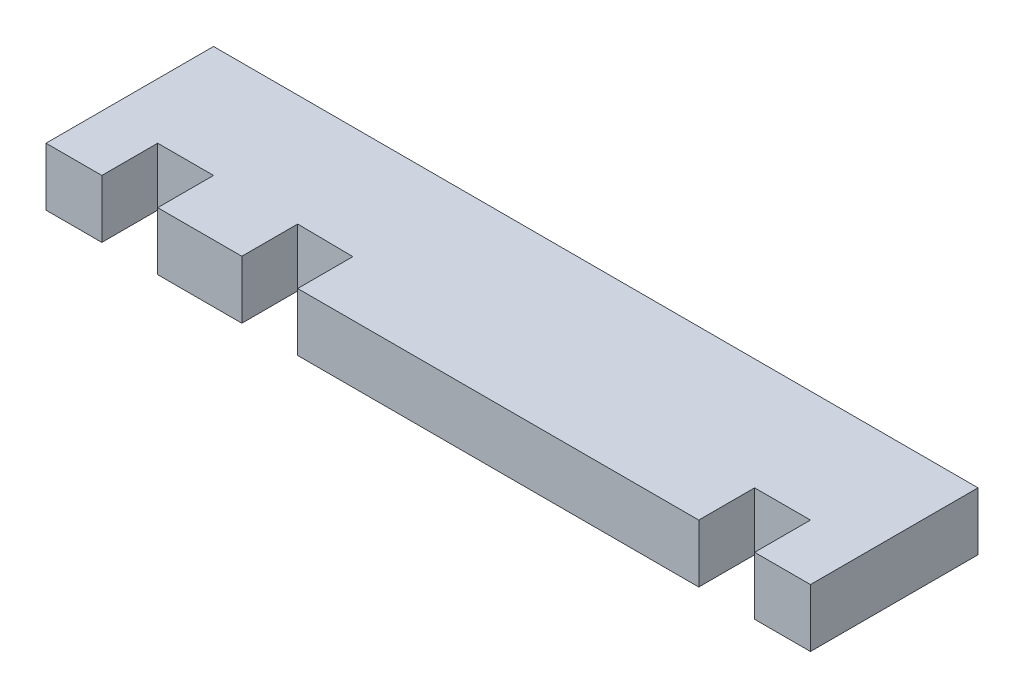
ISO-10303-21;
HEADER;
FILE_DESCRIPTION(('STEP AP214'),'2;1');
FILE_NAME('part.step','',(''),(''),'','','');
FILE_SCHEMA(('AUTOMOTIVE_DESIGN { 1 0 10303 214 1 1 1 1 }'));
ENDSEC;
DATA;
#1=APPLICATION_CONTEXT('core data for automotive mechanical design processes');
#2=APPLICATION_PROTOCOL_DEFINITION('international standard','automotive_design',2000,#1);
#3=PRODUCT_CONTEXT('',#1,'mechanical');
#4=PRODUCT('Part','Part','',(#3));
#5=PRODUCT_RELATED_PRODUCT_CATEGORY('part','',(#4));
#6=PRODUCT_DEFINITION_FORMATION('','',#4);
#7=PRODUCT_DEFINITION_CONTEXT('part definition',#1,'design');
#8=PRODUCT_DEFINITION('design','',#6,#7);
#9=PRODUCT_DEFINITION_SHAPE('','',#8);
#10=(LENGTH_UNIT() NAMED_UNIT(*) SI_UNIT(.MILLI.,.METRE.));
#11=(NAMED_UNIT(*) PLANE_ANGLE_UNIT() SI_UNIT($,.RADIAN.));
#12=(NAMED_UNIT(*) SI_UNIT($,.STERADIAN.) SOLID_ANGLE_UNIT());
#13=UNCERTAINTY_MEASURE_WITH_UNIT(LENGTH_MEASURE(1.E-05),#10,'distance_accuracy_value','');
#14=(GEOMETRIC_REPRESENTATION_CONTEXT(3) GLOBAL_UNCERTAINTY_ASSIGNED_CONTEXT((#13)) GLOBAL_UNIT_ASSIGNED_CONTEXT((#10,
#11,#12)) REPRESENTATION_CONTEXT('',''));
#15=CARTESIAN_POINT('',(0.,0.,0.));
#16=DIRECTION('',(0.,0.,1.));
#17=DIRECTION('',(1.,0.,0.));
#18=AXIS2_PLACEMENT_3D('',#15,#16,#17);
#19=CARTESIAN_POINT('',(26.35,4.,5.775));
#20=DIRECTION('',(-1.,0.,0.));
#21=DIRECTION('',(0.,0.,1.));
#22=AXIS2_PLACEMENT_3D('',#19,#20,#21);
#23=PLANE('',#22);
#24=DIRECTION('',(0.,0.,-1.));
#25=VECTOR('',#24,1.);
#26=CARTESIAN_POINT('',(26.35,0.,5.775));
#27=LINE('',#26,#25);
#28=CARTESIAN_POINT('',(26.35,0.,5.775));
#29=VERTEX_POINT('',#28);
#30=CARTESIAN_POINT('',(26.35,0.,-5.775));
#31=VERTEX_POINT('',#30);
#32=EDGE_CURVE('E303',#29,#31,#27,.T.);
#33=ORIENTED_EDGE('',*,*,#32,.T.);
#34=DIRECTION('',(0.,-1.,0.));
#35=VECTOR('',#34,1.);
#36=CARTESIAN_POINT('',(26.35,4.,-5.775));
#37=LINE('',#36,#35);
#38=CARTESIAN_POINT('',(26.35,4.,-5.775));
#39=VERTEX_POINT('',#38);
#40=EDGE_CURVE('E12',#39,#31,#37,.T.);
#41=ORIENTED_EDGE('',*,*,#40,.F.);
#42=DIRECTION('',(0.,0.,-1.));
#43=VECTOR('',#42,1.);
#44=CARTESIAN_POINT('',(26.35,4.,5.775));
#45=LINE('',#44,#43);
#46=CARTESIAN_POINT('',(26.35,4.,5.775));
#47=VERTEX_POINT('',#46);
#48=EDGE_CURVE('E244',#47,#39,#45,.T.);
#49=ORIENTED_EDGE('',*,*,#48,.F.);
#50=DIRECTION('',(0.,-1.,0.));
#51=VECTOR('',#50,1.);
#52=CARTESIAN_POINT('',(26.35,4.,5.775));
#53=LINE('',#52,#51);
#54=EDGE_CURVE('E181',#47,#29,#53,.T.);
#55=ORIENTED_EDGE('',*,*,#54,.T.);
#56=EDGE_LOOP('',(#33,#41,#49,#55));
#57=FACE_BOUND('',#56,.T.);
#58=ADVANCED_FACE('F38',(#57),#23,.F.);
#59=CARTESIAN_POINT('',(-26.35,4.,-5.775));
#60=DIRECTION('',(0.,0.,1.));
#61=DIRECTION('',(1.,0.,0.));
#62=AXIS2_PLACEMENT_3D('',#59,#60,#61);
#63=PLANE('',#62);
#64=DIRECTION('',(-1.,0.,0.));
#65=VECTOR('',#64,1.);
#66=CARTESIAN_POINT('',(-26.35,0.,-5.775));
#67=LINE('',#66,#65);
#68=CARTESIAN_POINT('',(-26.35,0.,-5.775));
#69=VERTEX_POINT('',#68);
#70=EDGE_CURVE('E297',#31,#69,#67,.T.);
#71=ORIENTED_EDGE('',*,*,#70,.T.);
#72=DIRECTION('',(0.,-1.,0.));
#73=VECTOR('',#72,1.);
#74=CARTESIAN_POINT('',(-26.35,4.,-5.775));
#75=LINE('',#74,#73);
#76=CARTESIAN_POINT('',(-26.35,4.,-5.775));
#77=VERTEX_POINT('',#76);
#78=EDGE_CURVE('E46',#77,#69,#75,.T.);
#79=ORIENTED_EDGE('',*,*,#78,.F.);
#80=DIRECTION('',(-1.,0.,0.));
#81=VECTOR('',#80,1.);
#82=CARTESIAN_POINT('',(-26.35,4.,-5.775));
#83=LINE('',#82,#81);
#84=EDGE_CURVE('E121',#39,#77,#83,.T.);
#85=ORIENTED_EDGE('',*,*,#84,.F.);
#86=ORIENTED_EDGE('',*,*,#40,.T.);
#87=EDGE_LOOP('',(#71,#79,#85,#86));
#88=FACE_BOUND('',#87,.T.);
#89=ADVANCED_FACE('F340',(#88),#63,.F.);
#90=CARTESIAN_POINT('',(-26.35,4.,-5.775));
#91=DIRECTION('',(1.,0.,0.));
#92=DIRECTION('',(0.,0.,-1.));
#93=AXIS2_PLACEMENT_3D('',#90,#91,#92);
#94=PLANE('',#93);
#95=DIRECTION('',(0.,0.,1.));
#96=VECTOR('',#95,1.);
#97=CARTESIAN_POINT('',(-26.35,0.,-5.775));
#98=LINE('',#97,#96);
#99=CARTESIAN_POINT('',(-26.35,0.,5.775));
#100=VERTEX_POINT('',#99);
#101=EDGE_CURVE('E292',#69,#100,#98,.T.);
#102=ORIENTED_EDGE('',*,*,#101,.T.);
#103=DIRECTION('',(0.,-1.,0.));
#104=VECTOR('',#103,1.);
#105=CARTESIAN_POINT('',(-26.35,4.,5.775));
#106=LINE('',#105,#104);
#107=CARTESIAN_POINT('',(-26.35,4.,5.775));
#108=VERTEX_POINT('',#107);
#109=EDGE_CURVE('E284',#108,#100,#106,.T.);
#110=ORIENTED_EDGE('',*,*,#109,.F.);
#111=DIRECTION('',(0.,0.,1.));
#112=VECTOR('',#111,1.);
#113=CARTESIAN_POINT('',(-26.35,4.,-5.775));
#114=LINE('',#113,#112);
#115=EDGE_CURVE('E236',#77,#108,#114,.T.);
#116=ORIENTED_EDGE('',*,*,#115,.F.);
#117=ORIENTED_EDGE('',*,*,#78,.T.);
#118=EDGE_LOOP('',(#102,#110,#116,#117));
#119=FACE_BOUND('',#118,.T.);
#120=ADVANCED_FACE('F290',(#119),#94,.F.);
#121=CARTESIAN_POINT('',(-26.35,4.,5.775));
#122=DIRECTION('',(0.,0.,-1.));
#123=DIRECTION('',(-1.,0.,0.));
#124=AXIS2_PLACEMENT_3D('',#121,#122,#123);
#125=PLANE('',#124);
#126=DIRECTION('',(1.,0.,0.));
#127=VECTOR('',#126,1.);
#128=CARTESIAN_POINT('',(-26.35,0.,5.775));
#129=LINE('',#128,#127);
#130=CARTESIAN_POINT('',(-22.5,0.,5.775));
#131=VERTEX_POINT('',#130);
#132=EDGE_CURVE('E299',#100,#131,#129,.T.);
#133=ORIENTED_EDGE('',*,*,#132,.T.);
#134=DIRECTION('',(0.,-1.,0.));
#135=VECTOR('',#134,1.);
#136=CARTESIAN_POINT('',(-22.5,4.,5.775));
#137=LINE('',#136,#135);
#138=CARTESIAN_POINT('',(-22.5,4.,5.775));
#139=VERTEX_POINT('',#138);
#140=EDGE_CURVE('E281',#139,#131,#137,.T.);
#141=ORIENTED_EDGE('',*,*,#140,.F.);
#142=DIRECTION('',(1.,0.,0.));
#143=VECTOR('',#142,1.);
#144=CARTESIAN_POINT('',(-26.35,4.,5.775));
#145=LINE('',#144,#143);
#146=EDGE_CURVE('E232',#108,#139,#145,.T.);
#147=ORIENTED_EDGE('',*,*,#146,.F.);
#148=ORIENTED_EDGE('',*,*,#109,.T.);
#149=EDGE_LOOP('',(#133,#141,#147,#148));
#150=FACE_BOUND('',#149,.T.);
#151=ADVANCED_FACE('F347',(#150),#125,.F.);
#152=CARTESIAN_POINT('',(-22.5,4.,5.775));
#153=DIRECTION('',(-1.,0.,0.));
#154=DIRECTION('',(0.,0.,1.));
#155=AXIS2_PLACEMENT_3D('',#152,#153,#154);
#156=PLANE('',#155);
#157=DIRECTION('',(0.,0.,-1.));
#158=VECTOR('',#157,1.);
#159=CARTESIAN_POINT('',(-22.5,0.,5.775));
#160=LINE('',#159,#158);
#161=CARTESIAN_POINT('',(-22.5,0.,1.925));
#162=VERTEX_POINT('',#161);
#163=EDGE_CURVE('E301',#131,#162,#160,.T.);
#164=ORIENTED_EDGE('',*,*,#163,.T.);
#165=DIRECTION('',(0.,-1.,0.));
#166=VECTOR('',#165,1.);
#167=CARTESIAN_POINT('',(-22.5,4.,1.925));
#168=LINE('',#167,#166);
#169=CARTESIAN_POINT('',(-22.5,4.,1.925));
#170=VERTEX_POINT('',#169);
#171=EDGE_CURVE('E278',#170,#162,#168,.T.);
#172=ORIENTED_EDGE('',*,*,#171,.F.);
#173=DIRECTION('',(0.,0.,-1.));
#174=VECTOR('',#173,1.);
#175=CARTESIAN_POINT('',(-22.5,4.,5.775));
#176=LINE('',#175,#174);
#177=EDGE_CURVE('E229',#139,#170,#176,.T.);
#178=ORIENTED_EDGE('',*,*,#177,.F.);
#179=ORIENTED_EDGE('',*,*,#140,.T.);
#180=EDGE_LOOP('',(#164,#172,#178,#179));
#181=FACE_BOUND('',#180,.T.);
#182=ADVANCED_FACE('F352',(#181),#156,.F.);
#183=CARTESIAN_POINT('',(-22.5,4.,1.925));
#184=DIRECTION('',(0.,0.,-1.));
#185=DIRECTION('',(-1.,0.,0.));
#186=AXIS2_PLACEMENT_3D('',#183,#184,#185);
#187=PLANE('',#186);
#188=DIRECTION('',(1.,0.,0.));
#189=VECTOR('',#188,1.);
#190=CARTESIAN_POINT('',(-22.5,0.,1.925));
#191=LINE('',#190,#189);
#192=CARTESIAN_POINT('',(-18.65,0.,1.925));
#193=VERTEX_POINT('',#192);
#194=EDGE_CURVE('E307',#162,#193,#191,.T.);
#195=ORIENTED_EDGE('',*,*,#194,.T.);
#196=DIRECTION('',(0.,-1.,0.));
#197=VECTOR('',#196,1.);
#198=CARTESIAN_POINT('',(-18.65,4.,1.925));
#199=LINE('',#198,#197);
#200=CARTESIAN_POINT('',(-18.65,4.,1.925));
#201=VERTEX_POINT('',#200);
#202=EDGE_CURVE('E275',#201,#193,#199,.T.);
#203=ORIENTED_EDGE('',*,*,#202,.F.);
#204=DIRECTION('',(1.,0.,0.));
#205=VECTOR('',#204,1.);
#206=CARTESIAN_POINT('',(-22.5,4.,1.925));
#207=LINE('',#206,#205);
#208=EDGE_CURVE('E221',#170,#201,#207,.T.);
#209=ORIENTED_EDGE('',*,*,#208,.F.);
#210=ORIENTED_EDGE('',*,*,#171,.T.);
#211=EDGE_LOOP('',(#195,#203,#209,#210));
#212=FACE_BOUND('',#211,.T.);
#213=ADVANCED_FACE('F356',(#212),#187,.F.);
#214=CARTESIAN_POINT('',(-18.65,4.,1.925));
#215=DIRECTION('',(1.,0.,0.));
#216=DIRECTION('',(0.,0.,-1.));
#217=AXIS2_PLACEMENT_3D('',#214,#215,#216);
#218=PLANE('',#217);
#219=DIRECTION('',(0.,0.,1.));
#220=VECTOR('',#219,1.);
#221=CARTESIAN_POINT('',(-18.65,0.,1.925));
#222=LINE('',#221,#220);
#223=CARTESIAN_POINT('',(-18.65,0.,5.775));
#224=VERTEX_POINT('',#223);
#225=EDGE_CURVE('E309',#193,#224,#222,.T.);
#226=ORIENTED_EDGE('',*,*,#225,.T.);
#227=DIRECTION('',(0.,-1.,0.));
#228=VECTOR('',#227,1.);
#229=CARTESIAN_POINT('',(-18.65,4.,5.775));
#230=LINE('',#229,#228);
#231=CARTESIAN_POINT('',(-18.65,4.,5.775));
#232=VERTEX_POINT('',#231);
#233=EDGE_CURVE('E272',#232,#224,#230,.T.);
#234=ORIENTED_EDGE('',*,*,#233,.F.);
#235=DIRECTION('',(0.,0.,1.));
#236=VECTOR('',#235,1.);
#237=CARTESIAN_POINT('',(-18.65,4.,1.925));
#238=LINE('',#237,#236);
#239=EDGE_CURVE('E217',#201,#232,#238,.T.);
#240=ORIENTED_EDGE('',*,*,#239,.F.);
#241=ORIENTED_EDGE('',*,*,#202,.T.);
#242=EDGE_LOOP('',(#226,#234,#240,#241));
#243=FACE_BOUND('',#242,.T.);
#244=ADVANCED_FACE('F360',(#243),#218,.F.);
#245=CARTESIAN_POINT('',(-18.65,4.,5.775));
#246=DIRECTION('',(0.,0.,-1.));
#247=DIRECTION('',(-1.,0.,0.));
#248=AXIS2_PLACEMENT_3D('',#245,#246,#247);
#249=PLANE('',#248);
#250=DIRECTION('',(1.,0.,0.));
#251=VECTOR('',#250,1.);
#252=CARTESIAN_POINT('',(-18.65,0.,5.775));
#253=LINE('',#252,#251);
#254=CARTESIAN_POINT('',(-12.8497071449384,0.,5.775));
#255=VERTEX_POINT('',#254);
#256=EDGE_CURVE('E311',#224,#255,#253,.T.);
#257=ORIENTED_EDGE('',*,*,#256,.T.);
#258=DIRECTION('',(0.,-1.,0.));
#259=VECTOR('',#258,1.);
#260=CARTESIAN_POINT('',(-12.8497071449384,4.,5.775));
#261=LINE('',#260,#259);
#262=CARTESIAN_POINT('',(-12.8497071449384,4.,5.775));
#263=VERTEX_POINT('',#262);
#264=EDGE_CURVE('E269',#263,#255,#261,.T.);
#265=ORIENTED_EDGE('',*,*,#264,.F.);
#266=DIRECTION('',(1.,0.,0.));
#267=VECTOR('',#266,1.);
#268=CARTESIAN_POINT('',(-18.65,4.,5.775));
#269=LINE('',#268,#267);
#270=EDGE_CURVE('E213',#232,#263,#269,.T.);
#271=ORIENTED_EDGE('',*,*,#270,.F.);
#272=ORIENTED_EDGE('',*,*,#233,.T.);
#273=EDGE_LOOP('',(#257,#265,#271,#272));
#274=FACE_BOUND('',#273,.T.);
#275=ADVANCED_FACE('F364',(#274),#249,.F.);
#276=CARTESIAN_POINT('',(-12.8497071449384,4.,5.775));
#277=DIRECTION('',(-1.,0.,0.));
#278=DIRECTION('',(0.,0.,1.));
#279=AXIS2_PLACEMENT_3D('',#276,#277,#278);
#280=PLANE('',#279);
#281=DIRECTION('',(0.,0.,-1.));
#282=VECTOR('',#281,1.);
#283=CARTESIAN_POINT('',(-12.8497071449384,0.,5.775));
#284=LINE('',#283,#282);
#285=CARTESIAN_POINT('',(-12.8497071449384,0.,1.925));
#286=VERTEX_POINT('',#285);
#287=EDGE_CURVE('E313',#255,#286,#284,.T.);
#288=ORIENTED_EDGE('',*,*,#287,.T.);
#289=DIRECTION('',(0.,-1.,0.));
#290=VECTOR('',#289,1.);
#291=CARTESIAN_POINT('',(-12.8497071449384,4.,1.925));
#292=LINE('',#291,#290);
#293=CARTESIAN_POINT('',(-12.8497071449384,4.,1.925));
#294=VERTEX_POINT('',#293);
#295=EDGE_CURVE('E266',#294,#286,#292,.T.);
#296=ORIENTED_EDGE('',*,*,#295,.F.);
#297=DIRECTION('',(0.,0.,-1.));
#298=VECTOR('',#297,1.);
#299=CARTESIAN_POINT('',(-12.8497071449384,4.,5.775));
#300=LINE('',#299,#298);
#301=EDGE_CURVE('E210',#263,#294,#300,.T.);
#302=ORIENTED_EDGE('',*,*,#301,.F.);
#303=ORIENTED_EDGE('',*,*,#264,.T.);
#304=EDGE_LOOP('',(#288,#296,#302,#303));
#305=FACE_BOUND('',#304,.T.);
#306=ADVANCED_FACE('F368',(#305),#280,.F.);
#307=CARTESIAN_POINT('',(-12.8497071449384,4.,1.925));
#308=DIRECTION('',(0.0123339658444028,0.,-0.999923933750237));
#309=DIRECTION('',(-0.999923933750237,0.,-0.0123339658444028));
#310=AXIS2_PLACEMENT_3D('',#307,#308,#309);
#311=PLANE('',#310);
#312=DIRECTION('',(0.999923933750237,0.,0.0123339658444028));
#313=VECTOR('',#312,1.);
#314=CARTESIAN_POINT('',(-12.8497071449384,0.,1.925));
#315=LINE('',#314,#313);
#316=CARTESIAN_POINT('',(-9.00000000000001,0.,1.97248576850095));
#317=VERTEX_POINT('',#316);
#318=EDGE_CURVE('E315',#286,#317,#315,.T.);
#319=ORIENTED_EDGE('',*,*,#318,.T.);
#320=DIRECTION('',(0.,-1.,0.));
#321=VECTOR('',#320,1.);
#322=CARTESIAN_POINT('',(-9.00000000000001,4.,1.97248576850095));
#323=LINE('',#322,#321);
#324=CARTESIAN_POINT('',(-9.00000000000001,4.,1.97248576850095));
#325=VERTEX_POINT('',#324);
#326=EDGE_CURVE('E263',#325,#317,#323,.T.);
#327=ORIENTED_EDGE('',*,*,#326,.F.);
#328=DIRECTION('',(0.999923933750237,0.,0.0123339658444028));
#329=VECTOR('',#328,1.);
#330=CARTESIAN_POINT('',(-12.8497071449384,4.,1.925));
#331=LINE('',#330,#329);
#332=EDGE_CURVE('E202',#294,#325,#331,.T.);
#333=ORIENTED_EDGE('',*,*,#332,.F.);
#334=ORIENTED_EDGE('',*,*,#295,.T.);
#335=EDGE_LOOP('',(#319,#327,#333,#334));
#336=FACE_BOUND('',#335,.T.);
#337=ADVANCED_FACE('F372',(#336),#311,.F.);
#338=CARTESIAN_POINT('',(-9.00000000000001,4.,1.97248576850095));
#339=DIRECTION('',(1.,0.,0.));
#340=DIRECTION('',(0.,0.,-1.));
#341=AXIS2_PLACEMENT_3D('',#338,#339,#340);
#342=PLANE('',#341);
#343=DIRECTION('',(0.,0.,1.));
#344=VECTOR('',#343,1.);
#345=CARTESIAN_POINT('',(-9.00000000000001,0.,1.97248576850095));
#346=LINE('',#345,#344);
#347=CARTESIAN_POINT('',(-9.00000000000001,0.,5.775));
#348=VERTEX_POINT('',#347);
#349=EDGE_CURVE('E317',#317,#348,#346,.T.);
#350=ORIENTED_EDGE('',*,*,#349,.T.);
#351=DIRECTION('',(0.,-1.,0.));
#352=VECTOR('',#351,1.);
#353=CARTESIAN_POINT('',(-9.00000000000001,4.,5.775));
#354=LINE('',#353,#352);
#355=CARTESIAN_POINT('',(-9.00000000000001,4.,5.775));
#356=VERTEX_POINT('',#355);
#357=EDGE_CURVE('E260',#356,#348,#354,.T.);
#358=ORIENTED_EDGE('',*,*,#357,.F.);
#359=DIRECTION('',(0.,0.,1.));
#360=VECTOR('',#359,1.);
#361=CARTESIAN_POINT('',(-9.00000000000001,4.,1.97248576850095));
#362=LINE('',#361,#360);
#363=EDGE_CURVE('E198',#325,#356,#362,.T.);
#364=ORIENTED_EDGE('',*,*,#363,.F.);
#365=ORIENTED_EDGE('',*,*,#326,.T.);
#366=EDGE_LOOP('',(#350,#358,#364,#365));
#367=FACE_BOUND('',#366,.T.);
#368=ADVANCED_FACE('F376',(#367),#342,.F.);
#369=CARTESIAN_POINT('',(18.65,4.,5.775));
#370=DIRECTION('',(0.,0.,-1.));
#371=DIRECTION('',(-1.,0.,0.));
#372=AXIS2_PLACEMENT_3D('',#369,#370,#371);
#373=PLANE('',#372);
#374=DIRECTION('',(1.,0.,0.));
#375=VECTOR('',#374,1.);
#376=CARTESIAN_POINT('',(18.65,0.,5.775));
#377=LINE('',#376,#375);
#378=CARTESIAN_POINT('',(18.65,0.,5.775));
#379=VERTEX_POINT('',#378);
#380=EDGE_CURVE('E319',#348,#379,#377,.T.);
#381=ORIENTED_EDGE('',*,*,#380,.T.);
#382=DIRECTION('',(0.,-1.,0.));
#383=VECTOR('',#382,1.);
#384=CARTESIAN_POINT('',(18.65,4.,5.775));
#385=LINE('',#384,#383);
#386=CARTESIAN_POINT('',(18.65,4.,5.775));
#387=VERTEX_POINT('',#386);
#388=EDGE_CURVE('E257',#387,#379,#385,.T.);
#389=ORIENTED_EDGE('',*,*,#388,.F.);
#390=DIRECTION('',(1.,0.,0.));
#391=VECTOR('',#390,1.);
#392=CARTESIAN_POINT('',(18.65,4.,5.775));
#393=LINE('',#392,#391);
#394=EDGE_CURVE('E194',#356,#387,#393,.T.);
#395=ORIENTED_EDGE('',*,*,#394,.F.);
#396=ORIENTED_EDGE('',*,*,#357,.T.);
#397=EDGE_LOOP('',(#381,#389,#395,#396));
#398=FACE_BOUND('',#397,.T.);
#399=ADVANCED_FACE('F380',(#398),#373,.F.);
#400=CARTESIAN_POINT('',(18.65,4.,5.775));
#401=DIRECTION('',(-1.,0.,0.));
#402=DIRECTION('',(0.,0.,1.));
#403=AXIS2_PLACEMENT_3D('',#400,#401,#402);
#404=PLANE('',#403);
#405=DIRECTION('',(0.,0.,-1.));
#406=VECTOR('',#405,1.);
#407=CARTESIAN_POINT('',(18.65,0.,5.775));
#408=LINE('',#407,#406);
#409=CARTESIAN_POINT('',(18.65,0.,1.925));
#410=VERTEX_POINT('',#409);
#411=EDGE_CURVE('E321',#379,#410,#408,.T.);
#412=ORIENTED_EDGE('',*,*,#411,.T.);
#413=DIRECTION('',(0.,-1.,0.));
#414=VECTOR('',#413,1.);
#415=CARTESIAN_POINT('',(18.65,4.,1.925));
#416=LINE('',#415,#414);
#417=CARTESIAN_POINT('',(18.65,4.,1.925));
#418=VERTEX_POINT('',#417);
#419=EDGE_CURVE('E174',#418,#410,#416,.T.);
#420=ORIENTED_EDGE('',*,*,#419,.F.);
#421=DIRECTION('',(0.,0.,-1.));
#422=VECTOR('',#421,1.);
#423=CARTESIAN_POINT('',(18.65,4.,5.775));
#424=LINE('',#423,#422);
#425=EDGE_CURVE('E164',#387,#418,#424,.T.);
#426=ORIENTED_EDGE('',*,*,#425,.F.);
#427=ORIENTED_EDGE('',*,*,#388,.T.);
#428=EDGE_LOOP('',(#412,#420,#426,#427));
#429=FACE_BOUND('',#428,.T.);
#430=ADVANCED_FACE('F324',(#429),#404,.F.);
#431=CARTESIAN_POINT('',(18.65,4.,1.925));
#432=DIRECTION('',(0.,0.,-1.));
#433=DIRECTION('',(-1.,0.,0.));
#434=AXIS2_PLACEMENT_3D('',#431,#432,#433);
#435=PLANE('',#434);
#436=DIRECTION('',(1.,0.,0.));
#437=VECTOR('',#436,1.);
#438=CARTESIAN_POINT('',(18.65,0.,1.925));
#439=LINE('',#438,#437);
#440=CARTESIAN_POINT('',(22.5,0.,1.925));
#441=VERTEX_POINT('',#440);
#442=EDGE_CURVE('E173',#410,#441,#439,.T.);
#443=ORIENTED_EDGE('',*,*,#442,.T.);
#444=DIRECTION('',(0.,-1.,0.));
#445=VECTOR('',#444,1.);
#446=CARTESIAN_POINT('',(22.5,4.,1.925));
#447=LINE('',#446,#445);
#448=CARTESIAN_POINT('',(22.5,4.,1.925));
#449=VERTEX_POINT('',#448);
#450=EDGE_CURVE('E170',#449,#441,#447,.T.);
#451=ORIENTED_EDGE('',*,*,#450,.F.);
#452=DIRECTION('',(1.,0.,0.));
#453=VECTOR('',#452,1.);
#454=CARTESIAN_POINT('',(18.65,4.,1.925));
#455=LINE('',#454,#453);
#456=EDGE_CURVE('E158',#418,#449,#455,.T.);
#457=ORIENTED_EDGE('',*,*,#456,.F.);
#458=ORIENTED_EDGE('',*,*,#419,.T.);
#459=EDGE_LOOP('',(#443,#451,#457,#458));
#460=FACE_BOUND('',#459,.T.);
#461=ADVANCED_FACE('F171',(#460),#435,.F.);
#462=CARTESIAN_POINT('',(22.5,4.,1.925));
#463=DIRECTION('',(1.,0.,0.));
#464=DIRECTION('',(0.,0.,-1.));
#465=AXIS2_PLACEMENT_3D('',#462,#463,#464);
#466=PLANE('',#465);
#467=DIRECTION('',(0.,0.,1.));
#468=VECTOR('',#467,1.);
#469=CARTESIAN_POINT('',(22.5,0.,1.925));
#470=LINE('',#469,#468);
#471=CARTESIAN_POINT('',(22.5,0.,5.775));
#472=VERTEX_POINT('',#471);
#473=EDGE_CURVE('E107',#441,#472,#470,.T.);
#474=ORIENTED_EDGE('',*,*,#473,.T.);
#475=DIRECTION('',(0.,-1.,0.));
#476=VECTOR('',#475,1.);
#477=CARTESIAN_POINT('',(22.5,4.,5.775));
#478=LINE('',#477,#476);
#479=CARTESIAN_POINT('',(22.5,4.,5.775));
#480=VERTEX_POINT('',#479);
#481=EDGE_CURVE('E175',#480,#472,#478,.T.);
#482=ORIENTED_EDGE('',*,*,#481,.F.);
#483=DIRECTION('',(0.,0.,1.));
#484=VECTOR('',#483,1.);
#485=CARTESIAN_POINT('',(22.5,4.,1.925));
#486=LINE('',#485,#484);
#487=EDGE_CURVE('E162',#449,#480,#486,.T.);
#488=ORIENTED_EDGE('',*,*,#487,.F.);
#489=ORIENTED_EDGE('',*,*,#450,.T.);
#490=EDGE_LOOP('',(#474,#482,#488,#489));
#491=FACE_BOUND('',#490,.T.);
#492=ADVANCED_FACE('F177',(#491),#466,.F.);
#493=CARTESIAN_POINT('',(22.5,4.,5.775));
#494=DIRECTION('',(0.,0.,-1.));
#495=DIRECTION('',(-1.,0.,0.));
#496=AXIS2_PLACEMENT_3D('',#493,#494,#495);
#497=PLANE('',#496);
#498=DIRECTION('',(1.,0.,0.));
#499=VECTOR('',#498,1.);
#500=CARTESIAN_POINT('',(22.5,0.,5.775));
#501=LINE('',#500,#499);
#502=EDGE_CURVE('E113',#472,#29,#501,.T.);
#503=ORIENTED_EDGE('',*,*,#502,.T.);
#504=ORIENTED_EDGE('',*,*,#54,.F.);
#505=DIRECTION('',(1.,0.,0.));
#506=VECTOR('',#505,1.);
#507=CARTESIAN_POINT('',(22.5,4.,5.775));
#508=LINE('',#507,#506);
#509=EDGE_CURVE('E54',#480,#47,#508,.T.);
#510=ORIENTED_EDGE('',*,*,#509,.F.);
#511=ORIENTED_EDGE('',*,*,#481,.T.);
#512=EDGE_LOOP('',(#503,#504,#510,#511));
#513=FACE_BOUND('',#512,.T.);
#514=ADVANCED_FACE('F329',(#513),#497,.F.);
#515=CARTESIAN_POINT('',(0.,4.,0.));
#516=DIRECTION('',(0.,-1.,0.));
#517=DIRECTION('',(0.,0.,-1.));
#518=AXIS2_PLACEMENT_3D('',#515,#516,#517);
#519=PLANE('',#518);
#520=ORIENTED_EDGE('',*,*,#48,.T.);
#521=ORIENTED_EDGE('',*,*,#84,.T.);
#522=ORIENTED_EDGE('',*,*,#115,.T.);
#523=ORIENTED_EDGE('',*,*,#146,.T.);
#524=ORIENTED_EDGE('',*,*,#177,.T.);
#525=ORIENTED_EDGE('',*,*,#208,.T.);
#526=ORIENTED_EDGE('',*,*,#239,.T.);
#527=ORIENTED_EDGE('',*,*,#270,.T.);
#528=ORIENTED_EDGE('',*,*,#301,.T.);
#529=ORIENTED_EDGE('',*,*,#332,.T.);
#530=ORIENTED_EDGE('',*,*,#363,.T.);
#531=ORIENTED_EDGE('',*,*,#394,.T.);
#532=ORIENTED_EDGE('',*,*,#425,.T.);
#533=ORIENTED_EDGE('',*,*,#456,.T.);
#534=ORIENTED_EDGE('',*,*,#487,.T.);
#535=ORIENTED_EDGE('',*,*,#509,.T.);
#536=EDGE_LOOP('',(#520,#521,#522,#523,#524,#525,#526,#527,#528,#529,#530,#531,#532,#533,#534,#535));
#537=FACE_BOUND('',#536,.T.);
#538=ADVANCED_FACE('F160',(#537),#519,.F.);
#539=CARTESIAN_POINT('',(0.,0.,0.));
#540=DIRECTION('',(0.,-1.,0.));
#541=DIRECTION('',(0.,0.,-1.));
#542=AXIS2_PLACEMENT_3D('',#539,#540,#541);
#543=PLANE('',#542);
#544=ORIENTED_EDGE('',*,*,#32,.F.);
#545=ORIENTED_EDGE('',*,*,#502,.F.);
#546=ORIENTED_EDGE('',*,*,#473,.F.);
#547=ORIENTED_EDGE('',*,*,#442,.F.);
#548=ORIENTED_EDGE('',*,*,#411,.F.);
#549=ORIENTED_EDGE('',*,*,#380,.F.);
#550=ORIENTED_EDGE('',*,*,#349,.F.);
#551=ORIENTED_EDGE('',*,*,#318,.F.);
#552=ORIENTED_EDGE('',*,*,#287,.F.);
#553=ORIENTED_EDGE('',*,*,#256,.F.);
#554=ORIENTED_EDGE('',*,*,#225,.F.);
#555=ORIENTED_EDGE('',*,*,#194,.F.);
#556=ORIENTED_EDGE('',*,*,#163,.F.);
#557=ORIENTED_EDGE('',*,*,#132,.F.);
#558=ORIENTED_EDGE('',*,*,#101,.F.);
#559=ORIENTED_EDGE('',*,*,#70,.F.);
#560=EDGE_LOOP('',(#544,#545,#546,#547,#548,#549,#550,#551,#552,#553,#554,#555,#556,#557,#558,#559));
#561=FACE_BOUND('',#560,.T.);
#562=ADVANCED_FACE('F296',(#561),#543,.T.);
#563=CLOSED_SHELL('',(#58,#89,#120,#151,#182,#213,#244,#275,#306,#337,#368,#399,#430,#461,#492,
#514,#538,#562));
#564=MANIFOLD_SOLID_BREP('B2',#563);
#565=ADVANCED_BREP_SHAPE_REPRESENTATION('',(#18,#564),#14);
#566=SHAPE_DEFINITION_REPRESENTATION(#9,#565);
ENDSEC;
END-ISO-10303-21;
